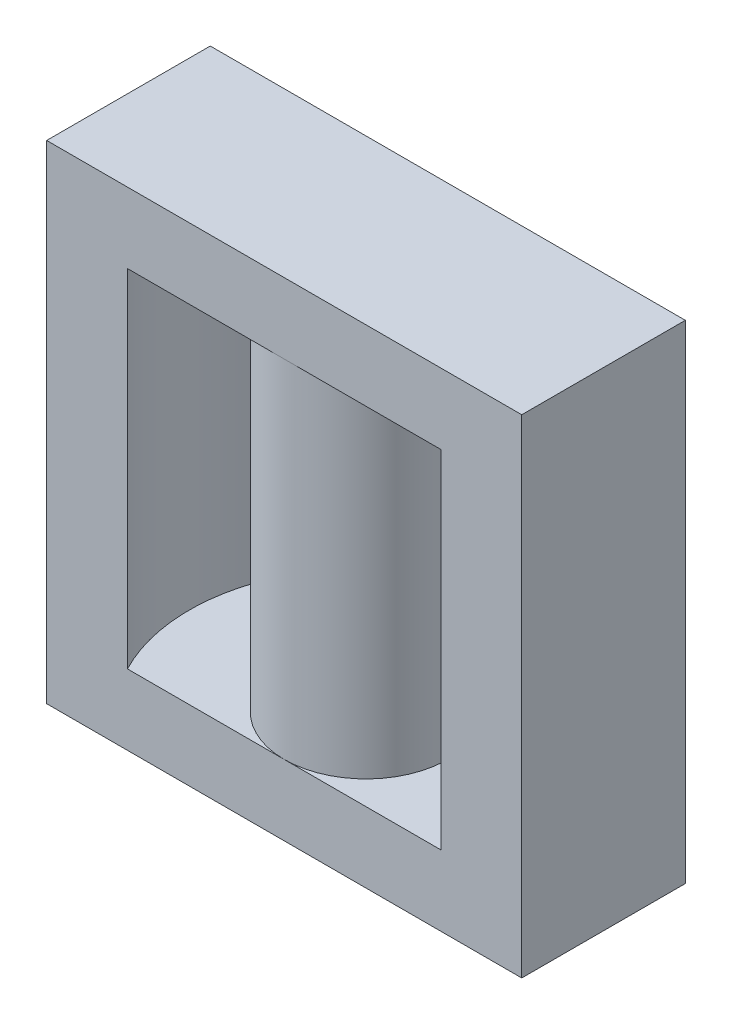
ISO-10303-21;
HEADER;
FILE_DESCRIPTION(('STEP AP214'),'2;1');
FILE_NAME('part.step','',(''),(''),'','','');
FILE_SCHEMA(('AUTOMOTIVE_DESIGN { 1 0 10303 214 1 1 1 1 }'));
ENDSEC;
DATA;
#1=APPLICATION_CONTEXT('core data for automotive mechanical design processes');
#2=APPLICATION_PROTOCOL_DEFINITION('international standard','automotive_design',2000,#1);
#3=PRODUCT_CONTEXT('',#1,'mechanical');
#4=PRODUCT('Part','Part','',(#3));
#5=PRODUCT_RELATED_PRODUCT_CATEGORY('part','',(#4));
#6=PRODUCT_DEFINITION_FORMATION('','',#4);
#7=PRODUCT_DEFINITION_CONTEXT('part definition',#1,'design');
#8=PRODUCT_DEFINITION('design','',#6,#7);
#9=PRODUCT_DEFINITION_SHAPE('','',#8);
#10=(LENGTH_UNIT() NAMED_UNIT(*) SI_UNIT(.MILLI.,.METRE.));
#11=(NAMED_UNIT(*) PLANE_ANGLE_UNIT() SI_UNIT($,.RADIAN.));
#12=(NAMED_UNIT(*) SI_UNIT($,.STERADIAN.) SOLID_ANGLE_UNIT());
#13=UNCERTAINTY_MEASURE_WITH_UNIT(LENGTH_MEASURE(1.E-05),#10,'distance_accuracy_value','');
#14=(GEOMETRIC_REPRESENTATION_CONTEXT(3) GLOBAL_UNCERTAINTY_ASSIGNED_CONTEXT((#13)) GLOBAL_UNIT_ASSIGNED_CONTEXT((#10,
#11,#12)) REPRESENTATION_CONTEXT('',''));
#15=CARTESIAN_POINT('',(0.,0.,0.));
#16=DIRECTION('',(0.,0.,1.));
#17=DIRECTION('',(1.,0.,0.));
#18=AXIS2_PLACEMENT_3D('',#15,#16,#17);
#19=CARTESIAN_POINT('',(0.,49.8,0.));
#20=DIRECTION('',(0.,-1.,0.));
#21=DIRECTION('',(0.,0.,-1.));
#22=AXIS2_PLACEMENT_3D('',#19,#20,#21);
#23=CYLINDRICAL_SURFACE('',#22,18.05);
#24=DIRECTION('',(0.,-1.,0.));
#25=VECTOR('',#24,1.);
#26=CARTESIAN_POINT('',(-16.002499804718,49.8,8.35));
#27=LINE('',#26,#25);
#28=CARTESIAN_POINT('',(-16.002499804718,42.6,8.35));
#29=VERTEX_POINT('',#28);
#30=CARTESIAN_POINT('',(-16.002499804718,7.2,8.35));
#31=VERTEX_POINT('',#30);
#32=EDGE_CURVE('E134',#29,#31,#27,.T.);
#33=ORIENTED_EDGE('',*,*,#32,.T.);
#34=CARTESIAN_POINT('',(0.,7.2,0.));
#35=DIRECTION('',(0.,-1.,0.));
#36=DIRECTION('',(0.,0.,-1.));
#37=AXIS2_PLACEMENT_3D('',#34,#35,#36);
#38=CIRCLE('',#37,18.05);
#39=CARTESIAN_POINT('',(-16.002499804718,7.2,-8.35));
#40=VERTEX_POINT('',#39);
#41=EDGE_CURVE('E121',#31,#40,#38,.T.);
#42=ORIENTED_EDGE('',*,*,#41,.T.);
#43=DIRECTION('',(0.,-1.,0.));
#44=VECTOR('',#43,1.);
#45=CARTESIAN_POINT('',(-16.002499804718,49.8,-8.35));
#46=LINE('',#45,#44);
#47=CARTESIAN_POINT('',(-16.002499804718,42.6,-8.35));
#48=VERTEX_POINT('',#47);
#49=EDGE_CURVE('E131',#48,#40,#46,.T.);
#50=ORIENTED_EDGE('',*,*,#49,.F.);
#51=CARTESIAN_POINT('',(0.,42.6,0.));
#52=DIRECTION('',(0.,1.,0.));
#53=DIRECTION('',(0.,0.,1.));
#54=AXIS2_PLACEMENT_3D('',#51,#52,#53);
#55=CIRCLE('',#54,18.05);
#56=EDGE_CURVE('E165',#48,#29,#55,.T.);
#57=ORIENTED_EDGE('',*,*,#56,.T.);
#58=EDGE_LOOP('',(#33,#42,#50,#57));
#59=FACE_BOUND('',#58,.T.);
#60=ADVANCED_FACE('F41',(#59),#23,.F.);
#61=CARTESIAN_POINT('',(0.,49.8,0.));
#62=DIRECTION('',(0.,-1.,0.));
#63=DIRECTION('',(0.,0.,-1.));
#64=AXIS2_PLACEMENT_3D('',#61,#62,#63);
#65=CYLINDRICAL_SURFACE('',#64,8.35);
#66=CARTESIAN_POINT('',(0.,42.6,0.));
#67=DIRECTION('',(0.,1.,0.));
#68=DIRECTION('',(0.,0.,1.));
#69=AXIS2_PLACEMENT_3D('',#66,#67,#68);
#70=CIRCLE('',#69,8.35);
#71=CARTESIAN_POINT('',(0.,42.6,-8.35));
#72=VERTEX_POINT('',#71);
#73=CARTESIAN_POINT('',(0.,42.6,8.35));
#74=VERTEX_POINT('',#73);
#75=EDGE_CURVE('E142',#72,#74,#70,.F.);
#76=ORIENTED_EDGE('',*,*,#75,.T.);
#77=EDGE_CURVE('E146',#74,#72,#70,.F.);
#78=ORIENTED_EDGE('',*,*,#77,.T.);
#79=EDGE_LOOP('',(#76,#78));
#80=FACE_BOUND('',#79,.T.);
#81=CARTESIAN_POINT('',(0.,7.2,0.));
#82=DIRECTION('',(0.,-1.,0.));
#83=DIRECTION('',(0.,0.,-1.));
#84=AXIS2_PLACEMENT_3D('',#81,#82,#83);
#85=CIRCLE('',#84,8.35);
#86=CARTESIAN_POINT('',(0.,7.2,-8.35));
#87=VERTEX_POINT('',#86);
#88=CARTESIAN_POINT('',(0.,7.2,8.35));
#89=VERTEX_POINT('',#88);
#90=EDGE_CURVE('E136',#87,#89,#85,.T.);
#91=ORIENTED_EDGE('',*,*,#90,.F.);
#92=EDGE_CURVE('E54',#89,#87,#85,.T.);
#93=ORIENTED_EDGE('',*,*,#92,.F.);
#94=EDGE_LOOP('',(#91,#93));
#95=FACE_BOUND('',#94,.T.);
#96=ADVANCED_FACE('F159',(#80,#95),#65,.T.);
#97=CARTESIAN_POINT('',(0.,49.8,0.));
#98=DIRECTION('',(0.,-1.,0.));
#99=DIRECTION('',(0.,0.,-1.));
#100=AXIS2_PLACEMENT_3D('',#97,#98,#99);
#101=CYLINDRICAL_SURFACE('',#100,18.05);
#102=DIRECTION('',(0.,-1.,0.));
#103=VECTOR('',#102,1.);
#104=CARTESIAN_POINT('',(16.002499804718,49.8,-8.35));
#105=LINE('',#104,#103);
#106=CARTESIAN_POINT('',(16.002499804718,42.6,-8.35));
#107=VERTEX_POINT('',#106);
#108=CARTESIAN_POINT('',(16.002499804718,7.2,-8.35));
#109=VERTEX_POINT('',#108);
#110=EDGE_CURVE('E62',#107,#109,#105,.T.);
#111=ORIENTED_EDGE('',*,*,#110,.T.);
#112=CARTESIAN_POINT('',(0.,7.2,0.));
#113=DIRECTION('',(0.,-1.,0.));
#114=DIRECTION('',(0.,0.,-1.));
#115=AXIS2_PLACEMENT_3D('',#112,#113,#114);
#116=CIRCLE('',#115,18.05);
#117=CARTESIAN_POINT('',(16.002499804718,7.2,8.35));
#118=VERTEX_POINT('',#117);
#119=EDGE_CURVE('E11',#109,#118,#116,.T.);
#120=ORIENTED_EDGE('',*,*,#119,.T.);
#121=DIRECTION('',(0.,-1.,0.));
#122=VECTOR('',#121,1.);
#123=CARTESIAN_POINT('',(16.002499804718,49.8,8.35));
#124=LINE('',#123,#122);
#125=CARTESIAN_POINT('',(16.002499804718,42.6,8.35));
#126=VERTEX_POINT('',#125);
#127=EDGE_CURVE('E176',#126,#118,#124,.T.);
#128=ORIENTED_EDGE('',*,*,#127,.F.);
#129=CARTESIAN_POINT('',(0.,42.6,0.));
#130=DIRECTION('',(0.,1.,0.));
#131=DIRECTION('',(0.,0.,1.));
#132=AXIS2_PLACEMENT_3D('',#129,#130,#131);
#133=CIRCLE('',#132,18.05);
#134=EDGE_CURVE('E48',#107,#126,#133,.F.);
#135=ORIENTED_EDGE('',*,*,#134,.F.);
#136=EDGE_LOOP('',(#111,#120,#128,#135));
#137=FACE_BOUND('',#136,.T.);
#138=ADVANCED_FACE('F221',(#137),#101,.F.);
#139=CARTESIAN_POINT('',(0.,42.6,0.));
#140=DIRECTION('',(0.,1.,0.));
#141=DIRECTION('',(0.,0.,1.));
#142=AXIS2_PLACEMENT_3D('',#139,#140,#141);
#143=PLANE('',#142);
#144=ORIENTED_EDGE('',*,*,#77,.F.);
#145=DIRECTION('',(1.,0.,0.));
#146=VECTOR('',#145,1.);
#147=CARTESIAN_POINT('',(-24.25,42.6,8.35));
#148=LINE('',#147,#146);
#149=EDGE_CURVE('E164',#29,#74,#148,.T.);
#150=ORIENTED_EDGE('',*,*,#149,.F.);
#151=ORIENTED_EDGE('',*,*,#56,.F.);
#152=DIRECTION('',(-1.,0.,0.));
#153=VECTOR('',#152,1.);
#154=CARTESIAN_POINT('',(-24.25,42.6,-8.35));
#155=LINE('',#154,#153);
#156=EDGE_CURVE('E141',#72,#48,#155,.T.);
#157=ORIENTED_EDGE('',*,*,#156,.F.);
#158=EDGE_LOOP('',(#144,#150,#151,#157));
#159=FACE_BOUND('',#158,.T.);
#160=ADVANCED_FACE('F163',(#159),#143,.F.);
#161=CARTESIAN_POINT('',(0.,49.8,-8.35));
#162=DIRECTION('',(0.,0.,-1.));
#163=DIRECTION('',(-1.,0.,0.));
#164=AXIS2_PLACEMENT_3D('',#161,#162,#163);
#165=PLANE('',#164);
#166=ORIENTED_EDGE('',*,*,#49,.T.);
#167=DIRECTION('',(1.,0.,0.));
#168=VECTOR('',#167,1.);
#169=CARTESIAN_POINT('',(-24.25,7.2,-8.35));
#170=LINE('',#169,#168);
#171=EDGE_CURVE('E117',#40,#87,#170,.T.);
#172=ORIENTED_EDGE('',*,*,#171,.T.);
#173=EDGE_CURVE('E126',#87,#109,#170,.T.);
#174=ORIENTED_EDGE('',*,*,#173,.T.);
#175=ORIENTED_EDGE('',*,*,#110,.F.);
#176=EDGE_CURVE('E166',#107,#72,#155,.T.);
#177=ORIENTED_EDGE('',*,*,#176,.T.);
#178=ORIENTED_EDGE('',*,*,#156,.T.);
#179=EDGE_LOOP('',(#166,#172,#174,#175,#177,#178));
#180=FACE_BOUND('',#179,.T.);
#181=DIRECTION('',(1.,0.,0.));
#182=VECTOR('',#181,1.);
#183=CARTESIAN_POINT('',(0.,0.,-8.35));
#184=LINE('',#183,#182);
#185=CARTESIAN_POINT('',(-24.25,0.,-8.35));
#186=VERTEX_POINT('',#185);
#187=CARTESIAN_POINT('',(24.25,0.,-8.35));
#188=VERTEX_POINT('',#187);
#189=EDGE_CURVE('E181',#186,#188,#184,.T.);
#190=ORIENTED_EDGE('',*,*,#189,.F.);
#191=DIRECTION('',(0.,-1.,0.));
#192=VECTOR('',#191,1.);
#193=CARTESIAN_POINT('',(-24.25,49.8,-8.35));
#194=LINE('',#193,#192);
#195=CARTESIAN_POINT('',(-24.25,49.8,-8.35));
#196=VERTEX_POINT('',#195);
#197=EDGE_CURVE('E143',#196,#186,#194,.T.);
#198=ORIENTED_EDGE('',*,*,#197,.F.);
#199=DIRECTION('',(1.,0.,0.));
#200=VECTOR('',#199,1.);
#201=CARTESIAN_POINT('',(0.,49.8,-8.35));
#202=LINE('',#201,#200);
#203=CARTESIAN_POINT('',(24.25,49.8,-8.35));
#204=VERTEX_POINT('',#203);
#205=EDGE_CURVE('E182',#196,#204,#202,.T.);
#206=ORIENTED_EDGE('',*,*,#205,.T.);
#207=DIRECTION('',(0.,1.,0.));
#208=VECTOR('',#207,1.);
#209=CARTESIAN_POINT('',(24.25,42.6,-8.35));
#210=LINE('',#209,#208);
#211=EDGE_CURVE('E177',#188,#204,#210,.T.);
#212=ORIENTED_EDGE('',*,*,#211,.F.);
#213=EDGE_LOOP('',(#190,#198,#206,#212));
#214=FACE_BOUND('',#213,.T.);
#215=ADVANCED_FACE('F138',(#180,#214),#165,.T.);
#216=CARTESIAN_POINT('',(-24.25,49.8,0.));
#217=DIRECTION('',(1.,0.,0.));
#218=DIRECTION('',(0.,0.,-1.));
#219=AXIS2_PLACEMENT_3D('',#216,#217,#218);
#220=PLANE('',#219);
#221=DIRECTION('',(0.,0.,1.));
#222=VECTOR('',#221,1.);
#223=CARTESIAN_POINT('',(-24.25,0.,0.));
#224=LINE('',#223,#222);
#225=CARTESIAN_POINT('',(-24.25,0.,8.35));
#226=VERTEX_POINT('',#225);
#227=EDGE_CURVE('E192',#186,#226,#224,.T.);
#228=ORIENTED_EDGE('',*,*,#227,.T.);
#229=DIRECTION('',(0.,-1.,0.));
#230=VECTOR('',#229,1.);
#231=CARTESIAN_POINT('',(-24.25,49.8,8.35));
#232=LINE('',#231,#230);
#233=CARTESIAN_POINT('',(-24.25,49.8,8.35));
#234=VERTEX_POINT('',#233);
#235=EDGE_CURVE('E148',#234,#226,#232,.T.);
#236=ORIENTED_EDGE('',*,*,#235,.F.);
#237=DIRECTION('',(0.,0.,1.));
#238=VECTOR('',#237,1.);
#239=CARTESIAN_POINT('',(-24.25,49.8,0.));
#240=LINE('',#239,#238);
#241=EDGE_CURVE('E185',#196,#234,#240,.T.);
#242=ORIENTED_EDGE('',*,*,#241,.F.);
#243=ORIENTED_EDGE('',*,*,#197,.T.);
#244=EDGE_LOOP('',(#228,#236,#242,#243));
#245=FACE_BOUND('',#244,.T.);
#246=ADVANCED_FACE('F206',(#245),#220,.F.);
#247=CARTESIAN_POINT('',(0.,49.8,8.35));
#248=DIRECTION('',(0.,0.,-1.));
#249=DIRECTION('',(-1.,0.,0.));
#250=AXIS2_PLACEMENT_3D('',#247,#248,#249);
#251=PLANE('',#250);
#252=DIRECTION('',(1.,0.,0.));
#253=VECTOR('',#252,1.);
#254=CARTESIAN_POINT('',(0.,0.,8.35));
#255=LINE('',#254,#253);
#256=CARTESIAN_POINT('',(24.25,0.,8.35));
#257=VERTEX_POINT('',#256);
#258=EDGE_CURVE('E186',#226,#257,#255,.T.);
#259=ORIENTED_EDGE('',*,*,#258,.T.);
#260=DIRECTION('',(0.,1.,0.));
#261=VECTOR('',#260,1.);
#262=CARTESIAN_POINT('',(24.25,42.6,8.35));
#263=LINE('',#262,#261);
#264=CARTESIAN_POINT('',(24.25,49.8,8.35));
#265=VERTEX_POINT('',#264);
#266=EDGE_CURVE('E168',#257,#265,#263,.T.);
#267=ORIENTED_EDGE('',*,*,#266,.T.);
#268=DIRECTION('',(1.,0.,0.));
#269=VECTOR('',#268,1.);
#270=CARTESIAN_POINT('',(0.,49.8,8.35));
#271=LINE('',#270,#269);
#272=EDGE_CURVE('E188',#234,#265,#271,.T.);
#273=ORIENTED_EDGE('',*,*,#272,.F.);
#274=ORIENTED_EDGE('',*,*,#235,.T.);
#275=EDGE_LOOP('',(#259,#267,#273,#274));
#276=FACE_BOUND('',#275,.T.);
#277=DIRECTION('',(-1.,0.,0.));
#278=VECTOR('',#277,1.);
#279=CARTESIAN_POINT('',(-24.25,7.2,8.35));
#280=LINE('',#279,#278);
#281=EDGE_CURVE('E125',#89,#31,#280,.T.);
#282=ORIENTED_EDGE('',*,*,#281,.T.);
#283=ORIENTED_EDGE('',*,*,#32,.F.);
#284=ORIENTED_EDGE('',*,*,#149,.T.);
#285=EDGE_CURVE('E169',#74,#126,#148,.T.);
#286=ORIENTED_EDGE('',*,*,#285,.T.);
#287=ORIENTED_EDGE('',*,*,#127,.T.);
#288=EDGE_CURVE('E219',#118,#89,#280,.T.);
#289=ORIENTED_EDGE('',*,*,#288,.T.);
#290=EDGE_LOOP('',(#282,#283,#284,#286,#287,#289));
#291=FACE_BOUND('',#290,.T.);
#292=ADVANCED_FACE('F199',(#276,#291),#251,.F.);
#293=CARTESIAN_POINT('',(0.,49.8,0.));
#294=DIRECTION('',(0.,1.,0.));
#295=DIRECTION('',(0.,0.,1.));
#296=AXIS2_PLACEMENT_3D('',#293,#294,#295);
#297=PLANE('',#296);
#298=ORIENTED_EDGE('',*,*,#272,.T.);
#299=DIRECTION('',(0.,0.,-1.));
#300=VECTOR('',#299,1.);
#301=CARTESIAN_POINT('',(24.25,49.8,-8.35));
#302=LINE('',#301,#300);
#303=EDGE_CURVE('E173',#265,#204,#302,.T.);
#304=ORIENTED_EDGE('',*,*,#303,.T.);
#305=ORIENTED_EDGE('',*,*,#205,.F.);
#306=ORIENTED_EDGE('',*,*,#241,.T.);
#307=EDGE_LOOP('',(#298,#304,#305,#306));
#308=FACE_BOUND('',#307,.T.);
#309=ADVANCED_FACE('F269',(#308),#297,.T.);
#310=CARTESIAN_POINT('',(0.,0.,0.));
#311=DIRECTION('',(0.,1.,0.));
#312=DIRECTION('',(0.,0.,1.));
#313=AXIS2_PLACEMENT_3D('',#310,#311,#312);
#314=PLANE('',#313);
#315=ORIENTED_EDGE('',*,*,#189,.T.);
#316=DIRECTION('',(0.,0.,1.));
#317=VECTOR('',#316,1.);
#318=CARTESIAN_POINT('',(24.25,0.,0.));
#319=LINE('',#318,#317);
#320=EDGE_CURVE('E135',#188,#257,#319,.T.);
#321=ORIENTED_EDGE('',*,*,#320,.T.);
#322=ORIENTED_EDGE('',*,*,#258,.F.);
#323=ORIENTED_EDGE('',*,*,#227,.F.);
#324=EDGE_LOOP('',(#315,#321,#322,#323));
#325=FACE_BOUND('',#324,.T.);
#326=ADVANCED_FACE('F210',(#325),#314,.F.);
#327=CARTESIAN_POINT('',(24.25,42.6,-8.35));
#328=DIRECTION('',(1.,0.,0.));
#329=DIRECTION('',(0.,0.,-1.));
#330=AXIS2_PLACEMENT_3D('',#327,#328,#329);
#331=PLANE('',#330);
#332=ORIENTED_EDGE('',*,*,#211,.T.);
#333=ORIENTED_EDGE('',*,*,#303,.F.);
#334=ORIENTED_EDGE('',*,*,#266,.F.);
#335=ORIENTED_EDGE('',*,*,#320,.F.);
#336=EDGE_LOOP('',(#332,#333,#334,#335));
#337=FACE_BOUND('',#336,.T.);
#338=ADVANCED_FACE('F227',(#337),#331,.T.);
#339=ORIENTED_EDGE('',*,*,#176,.F.);
#340=ORIENTED_EDGE('',*,*,#134,.T.);
#341=ORIENTED_EDGE('',*,*,#285,.F.);
#342=ORIENTED_EDGE('',*,*,#75,.F.);
#343=EDGE_LOOP('',(#339,#340,#341,#342));
#344=FACE_BOUND('',#343,.T.);
#345=ADVANCED_FACE('F225',(#344),#143,.F.);
#346=CARTESIAN_POINT('',(0.,7.2,0.));
#347=DIRECTION('',(0.,-1.,0.));
#348=DIRECTION('',(0.,0.,-1.));
#349=AXIS2_PLACEMENT_3D('',#346,#347,#348);
#350=PLANE('',#349);
#351=ORIENTED_EDGE('',*,*,#41,.F.);
#352=ORIENTED_EDGE('',*,*,#281,.F.);
#353=ORIENTED_EDGE('',*,*,#92,.T.);
#354=ORIENTED_EDGE('',*,*,#171,.F.);
#355=EDGE_LOOP('',(#351,#352,#353,#354));
#356=FACE_BOUND('',#355,.T.);
#357=ADVANCED_FACE('F119',(#356),#350,.F.);
#358=ORIENTED_EDGE('',*,*,#173,.F.);
#359=ORIENTED_EDGE('',*,*,#90,.T.);
#360=ORIENTED_EDGE('',*,*,#288,.F.);
#361=ORIENTED_EDGE('',*,*,#119,.F.);
#362=EDGE_LOOP('',(#358,#359,#360,#361));
#363=FACE_BOUND('',#362,.T.);
#364=ADVANCED_FACE('F223',(#363),#350,.F.);
#365=CLOSED_SHELL('',(#60,#96,#138,#160,#215,#246,#292,#309,#326,#338,#345,#357,#364));
#366=MANIFOLD_SOLID_BREP('B2',#365);
#367=ADVANCED_BREP_SHAPE_REPRESENTATION('',(#18,#366),#14);
#368=SHAPE_DEFINITION_REPRESENTATION(#9,#367);
ENDSEC;
END-ISO-10303-21;
